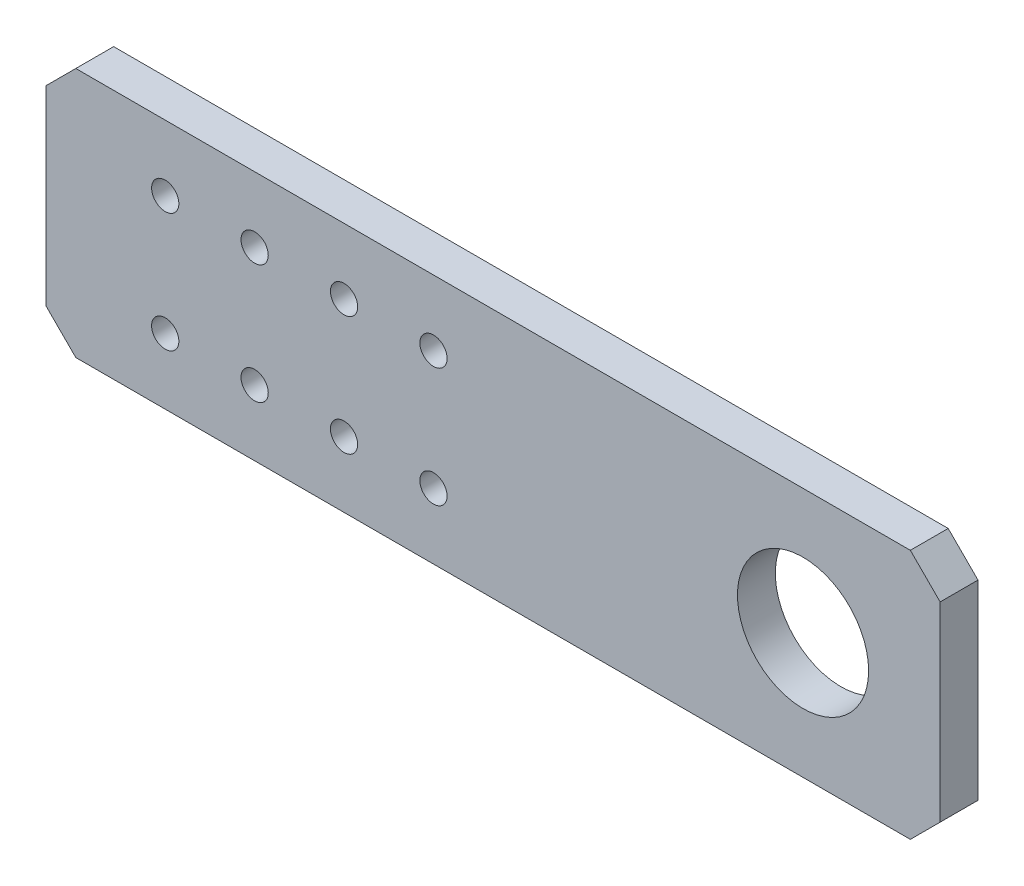
ISO-10303-21;
HEADER;
FILE_DESCRIPTION(('STEP AP214'),'2;1');
FILE_NAME('part.step','',(''),(''),'','','');
FILE_SCHEMA(('AUTOMOTIVE_DESIGN { 1 0 10303 214 1 1 1 1 }'));
ENDSEC;
DATA;
#1=APPLICATION_CONTEXT('core data for automotive mechanical design processes');
#2=APPLICATION_PROTOCOL_DEFINITION('international standard','automotive_design',2000,#1);
#3=PRODUCT_CONTEXT('',#1,'mechanical');
#4=PRODUCT('Part','Part','',(#3));
#5=PRODUCT_RELATED_PRODUCT_CATEGORY('part','',(#4));
#6=PRODUCT_DEFINITION_FORMATION('','',#4);
#7=PRODUCT_DEFINITION_CONTEXT('part definition',#1,'design');
#8=PRODUCT_DEFINITION('design','',#6,#7);
#9=PRODUCT_DEFINITION_SHAPE('','',#8);
#10=(LENGTH_UNIT() NAMED_UNIT(*) SI_UNIT(.MILLI.,.METRE.));
#11=(NAMED_UNIT(*) PLANE_ANGLE_UNIT() SI_UNIT($,.RADIAN.));
#12=(NAMED_UNIT(*) SI_UNIT($,.STERADIAN.) SOLID_ANGLE_UNIT());
#13=UNCERTAINTY_MEASURE_WITH_UNIT(LENGTH_MEASURE(1.E-05),#10,'distance_accuracy_value','');
#14=(GEOMETRIC_REPRESENTATION_CONTEXT(3) GLOBAL_UNCERTAINTY_ASSIGNED_CONTEXT((#13)) GLOBAL_UNIT_ASSIGNED_CONTEXT((#10,
#11,#12)) REPRESENTATION_CONTEXT('',''));
#15=CARTESIAN_POINT('',(0.,0.,0.));
#16=DIRECTION('',(0.,0.,1.));
#17=DIRECTION('',(1.,0.,0.));
#18=AXIS2_PLACEMENT_3D('',#15,#16,#17);
#19=CARTESIAN_POINT('',(-102.5,21.,6.35));
#20=DIRECTION('',(0.,-1.,0.));
#21=DIRECTION('',(0.,0.,-1.));
#22=AXIS2_PLACEMENT_3D('',#19,#20,#21);
#23=PLANE('',#22);
#24=DIRECTION('',(0.,0.,1.));
#25=VECTOR('',#24,1.);
#26=CARTESIAN_POINT('',(-42.5,21.,-3.65));
#27=LINE('',#26,#25);
#28=CARTESIAN_POINT('',(-42.5,21.,0.));
#29=VERTEX_POINT('',#28);
#30=CARTESIAN_POINT('',(-42.5,21.,6.35));
#31=VERTEX_POINT('',#30);
#32=EDGE_CURVE('E122',#29,#31,#27,.T.);
#33=ORIENTED_EDGE('',*,*,#32,.T.);
#34=DIRECTION('',(-1.,0.,0.));
#35=VECTOR('',#34,1.);
#36=CARTESIAN_POINT('',(-102.5,21.,6.35));
#37=LINE('',#36,#35);
#38=CARTESIAN_POINT('',(97.5,21.,6.35));
#39=VERTEX_POINT('',#38);
#40=EDGE_CURVE('E157',#39,#31,#37,.T.);
#41=ORIENTED_EDGE('',*,*,#40,.F.);
#42=DIRECTION('',(0.,0.,-1.));
#43=VECTOR('',#42,1.);
#44=CARTESIAN_POINT('',(97.5,21.,6.35));
#45=LINE('',#44,#43);
#46=CARTESIAN_POINT('',(97.5,21.,0.));
#47=VERTEX_POINT('',#46);
#48=EDGE_CURVE('E173',#39,#47,#45,.T.);
#49=ORIENTED_EDGE('',*,*,#48,.T.);
#50=DIRECTION('',(-1.,0.,0.));
#51=VECTOR('',#50,1.);
#52=CARTESIAN_POINT('',(-102.5,21.,0.));
#53=LINE('',#52,#51);
#54=EDGE_CURVE('E165',#47,#29,#53,.T.);
#55=ORIENTED_EDGE('',*,*,#54,.T.);
#56=EDGE_LOOP('',(#33,#41,#49,#55));
#57=FACE_BOUND('',#56,.T.);
#58=ADVANCED_FACE('F33',(#57),#23,.F.);
#59=CARTESIAN_POINT('',(-102.5,-21.,6.35));
#60=DIRECTION('',(0.,1.,0.));
#61=DIRECTION('',(0.,0.,1.));
#62=AXIS2_PLACEMENT_3D('',#59,#60,#61);
#63=PLANE('',#62);
#64=DIRECTION('',(0.,0.,1.));
#65=VECTOR('',#64,1.);
#66=CARTESIAN_POINT('',(-42.5,-21.,-3.65));
#67=LINE('',#66,#65);
#68=CARTESIAN_POINT('',(-42.5,-21.,0.));
#69=VERTEX_POINT('',#68);
#70=CARTESIAN_POINT('',(-42.5,-21.,6.35));
#71=VERTEX_POINT('',#70);
#72=EDGE_CURVE('E111',#69,#71,#67,.T.);
#73=ORIENTED_EDGE('',*,*,#72,.F.);
#74=DIRECTION('',(1.,0.,0.));
#75=VECTOR('',#74,1.);
#76=CARTESIAN_POINT('',(-102.5,-21.,0.));
#77=LINE('',#76,#75);
#78=CARTESIAN_POINT('',(97.4999999999999,-21.,0.));
#79=VERTEX_POINT('',#78);
#80=EDGE_CURVE('E158',#69,#79,#77,.T.);
#81=ORIENTED_EDGE('',*,*,#80,.T.);
#82=DIRECTION('',(0.,0.,1.));
#83=VECTOR('',#82,1.);
#84=CARTESIAN_POINT('',(97.5,-21.,6.35));
#85=LINE('',#84,#83);
#86=CARTESIAN_POINT('',(97.4999999999999,-21.,6.35));
#87=VERTEX_POINT('',#86);
#88=EDGE_CURVE('E180',#79,#87,#85,.T.);
#89=ORIENTED_EDGE('',*,*,#88,.T.);
#90=DIRECTION('',(1.,0.,0.));
#91=VECTOR('',#90,1.);
#92=CARTESIAN_POINT('',(-102.5,-21.,6.35));
#93=LINE('',#92,#91);
#94=EDGE_CURVE('E56',#71,#87,#93,.T.);
#95=ORIENTED_EDGE('',*,*,#94,.F.);
#96=EDGE_LOOP('',(#73,#81,#89,#95));
#97=FACE_BOUND('',#96,.T.);
#98=ADVANCED_FACE('F220',(#97),#63,.F.);
#99=CARTESIAN_POINT('',(0.,0.,6.35));
#100=DIRECTION('',(0.,0.,1.));
#101=DIRECTION('',(1.,0.,0.));
#102=AXIS2_PLACEMENT_3D('',#99,#100,#101);
#103=PLANE('',#102);
#104=CARTESIAN_POINT('',(-12.5,-10.,6.35));
#105=DIRECTION('',(0.,0.,1.));
#106=DIRECTION('',(1.,0.,0.));
#107=AXIS2_PLACEMENT_3D('',#104,#105,#106);
#108=CIRCLE('',#107,2.286);
#109=CARTESIAN_POINT('',(-10.214,-10.,6.35));
#110=VERTEX_POINT('',#109);
#111=EDGE_CURVE('E131',#110,#110,#108,.F.);
#112=ORIENTED_EDGE('',*,*,#111,.T.);
#113=EDGE_LOOP('',(#112));
#114=FACE_BOUND('',#113,.T.);
#115=CARTESIAN_POINT('',(-27.5,-10.,6.35));
#116=DIRECTION('',(0.,0.,1.));
#117=DIRECTION('',(1.,0.,0.));
#118=AXIS2_PLACEMENT_3D('',#115,#116,#117);
#119=CIRCLE('',#118,2.286);
#120=CARTESIAN_POINT('',(-25.214,-10.,6.35));
#121=VERTEX_POINT('',#120);
#122=EDGE_CURVE('E134',#121,#121,#119,.F.);
#123=ORIENTED_EDGE('',*,*,#122,.T.);
#124=EDGE_LOOP('',(#123));
#125=FACE_BOUND('',#124,.T.);
#126=CARTESIAN_POINT('',(17.5,-9.99999999999999,6.35));
#127=DIRECTION('',(0.,0.,-1.));
#128=DIRECTION('',(-1.,0.,0.));
#129=AXIS2_PLACEMENT_3D('',#126,#127,#128);
#130=CIRCLE('',#129,2.286);
#131=CARTESIAN_POINT('',(15.214,-9.99999999999999,6.35));
#132=VERTEX_POINT('',#131);
#133=EDGE_CURVE('E143',#132,#132,#130,.T.);
#134=ORIENTED_EDGE('',*,*,#133,.T.);
#135=EDGE_LOOP('',(#134));
#136=FACE_BOUND('',#135,.T.);
#137=CARTESIAN_POINT('',(2.49999999999999,-9.99999999999999,6.35));
#138=DIRECTION('',(0.,0.,-1.));
#139=DIRECTION('',(-1.,0.,0.));
#140=AXIS2_PLACEMENT_3D('',#137,#138,#139);
#141=CIRCLE('',#140,2.286);
#142=CARTESIAN_POINT('',(0.213999999999994,-9.99999999999999,6.35));
#143=VERTEX_POINT('',#142);
#144=EDGE_CURVE('E146',#143,#143,#141,.T.);
#145=ORIENTED_EDGE('',*,*,#144,.T.);
#146=EDGE_LOOP('',(#145));
#147=FACE_BOUND('',#146,.T.);
#148=CARTESIAN_POINT('',(79.5,0.,6.35));
#149=DIRECTION('',(0.,0.,1.));
#150=DIRECTION('',(1.,0.,0.));
#151=AXIS2_PLACEMENT_3D('',#148,#149,#150);
#152=CIRCLE('',#151,11.);
#153=CARTESIAN_POINT('',(90.5,0.,6.35));
#154=VERTEX_POINT('',#153);
#155=EDGE_CURVE('E149',#154,#154,#152,.T.);
#156=ORIENTED_EDGE('',*,*,#155,.F.);
#157=EDGE_LOOP('',(#156));
#158=FACE_BOUND('',#157,.T.);
#159=DIRECTION('',(0.,-1.,0.));
#160=VECTOR('',#159,1.);
#161=CARTESIAN_POINT('',(-47.5,0.,6.35));
#162=LINE('',#161,#160);
#163=CARTESIAN_POINT('',(-47.5,16.,6.35));
#164=VERTEX_POINT('',#163);
#165=CARTESIAN_POINT('',(-47.5,-16.,6.35));
#166=VERTEX_POINT('',#165);
#167=EDGE_CURVE('E100',#164,#166,#162,.T.);
#168=ORIENTED_EDGE('',*,*,#167,.T.);
#169=DIRECTION('',(0.707106781186547,-0.707106781186548,0.));
#170=VECTOR('',#169,1.);
#171=CARTESIAN_POINT('',(-31.75,-31.75,6.35));
#172=LINE('',#171,#170);
#173=EDGE_CURVE('E108',#166,#71,#172,.T.);
#174=ORIENTED_EDGE('',*,*,#173,.T.);
#175=ORIENTED_EDGE('',*,*,#94,.T.);
#176=DIRECTION('',(-0.707106781186548,-0.707106781186548,0.));
#177=VECTOR('',#176,1.);
#178=CARTESIAN_POINT('',(59.25,-59.25,6.35));
#179=LINE('',#178,#177);
#180=CARTESIAN_POINT('',(102.5,-16.,6.35));
#181=VERTEX_POINT('',#180);
#182=EDGE_CURVE('E176',#87,#181,#179,.F.);
#183=ORIENTED_EDGE('',*,*,#182,.T.);
#184=DIRECTION('',(0.,1.,0.));
#185=VECTOR('',#184,1.);
#186=CARTESIAN_POINT('',(102.5,21.,6.35));
#187=LINE('',#186,#185);
#188=CARTESIAN_POINT('',(102.5,16.,6.35));
#189=VERTEX_POINT('',#188);
#190=EDGE_CURVE('E154',#181,#189,#187,.T.);
#191=ORIENTED_EDGE('',*,*,#190,.T.);
#192=DIRECTION('',(0.707106781186548,-0.707106781186548,0.));
#193=VECTOR('',#192,1.);
#194=CARTESIAN_POINT('',(59.25,59.25,6.35));
#195=LINE('',#194,#193);
#196=EDGE_CURVE('E178',#189,#39,#195,.F.);
#197=ORIENTED_EDGE('',*,*,#196,.T.);
#198=ORIENTED_EDGE('',*,*,#40,.T.);
#199=DIRECTION('',(-0.707106781186548,-0.707106781186547,0.));
#200=VECTOR('',#199,1.);
#201=CARTESIAN_POINT('',(-31.75,31.75,6.35));
#202=LINE('',#201,#200);
#203=EDGE_CURVE('E106',#31,#164,#202,.T.);
#204=ORIENTED_EDGE('',*,*,#203,.T.);
#205=EDGE_LOOP('',(#168,#174,#175,#183,#191,#197,#198,#204));
#206=FACE_BOUND('',#205,.T.);
#207=CARTESIAN_POINT('',(17.5,9.99999999999999,6.35));
#208=DIRECTION('',(0.,0.,1.));
#209=DIRECTION('',(1.,0.,0.));
#210=AXIS2_PLACEMENT_3D('',#207,#208,#209);
#211=CIRCLE('',#210,2.286);
#212=CARTESIAN_POINT('',(19.786,9.99999999999999,6.35));
#213=VERTEX_POINT('',#212);
#214=EDGE_CURVE('E140',#213,#213,#211,.T.);
#215=ORIENTED_EDGE('',*,*,#214,.F.);
#216=EDGE_LOOP('',(#215));
#217=FACE_BOUND('',#216,.T.);
#218=CARTESIAN_POINT('',(2.49999999999999,9.99999999999998,6.35));
#219=DIRECTION('',(0.,0.,1.));
#220=DIRECTION('',(1.,0.,0.));
#221=AXIS2_PLACEMENT_3D('',#218,#219,#220);
#222=CIRCLE('',#221,2.286);
#223=CARTESIAN_POINT('',(4.78599999999999,9.99999999999998,6.35));
#224=VERTEX_POINT('',#223);
#225=EDGE_CURVE('E137',#224,#224,#222,.T.);
#226=ORIENTED_EDGE('',*,*,#225,.F.);
#227=EDGE_LOOP('',(#226));
#228=FACE_BOUND('',#227,.T.);
#229=CARTESIAN_POINT('',(-12.5,9.99999999999999,6.35));
#230=DIRECTION('',(0.,0.,1.));
#231=DIRECTION('',(1.,0.,0.));
#232=AXIS2_PLACEMENT_3D('',#229,#230,#231);
#233=CIRCLE('',#232,2.286);
#234=CARTESIAN_POINT('',(-10.214,9.99999999999999,6.35));
#235=VERTEX_POINT('',#234);
#236=EDGE_CURVE('E128',#235,#235,#233,.T.);
#237=ORIENTED_EDGE('',*,*,#236,.F.);
#238=EDGE_LOOP('',(#237));
#239=FACE_BOUND('',#238,.T.);
#240=CARTESIAN_POINT('',(-27.5,9.99999999999998,6.35));
#241=DIRECTION('',(0.,0.,1.));
#242=DIRECTION('',(1.,0.,0.));
#243=AXIS2_PLACEMENT_3D('',#240,#241,#242);
#244=CIRCLE('',#243,2.286);
#245=CARTESIAN_POINT('',(-25.214,9.99999999999998,6.35));
#246=VERTEX_POINT('',#245);
#247=EDGE_CURVE('E112',#246,#246,#244,.T.);
#248=ORIENTED_EDGE('',*,*,#247,.F.);
#249=EDGE_LOOP('',(#248));
#250=FACE_BOUND('',#249,.T.);
#251=ADVANCED_FACE('F114',(#114,#125,#136,#147,#158,#206,#217,#228,#239,#250),#103,.T.);
#252=CARTESIAN_POINT('',(0.,0.,0.));
#253=DIRECTION('',(0.,0.,1.));
#254=DIRECTION('',(1.,0.,0.));
#255=AXIS2_PLACEMENT_3D('',#252,#253,#254);
#256=PLANE('',#255);
#257=DIRECTION('',(0.707106781186547,-0.707106781186548,0.));
#258=VECTOR('',#257,1.);
#259=CARTESIAN_POINT('',(-31.75,-31.75,0.));
#260=LINE('',#259,#258);
#261=CARTESIAN_POINT('',(-47.5,-16.,0.));
#262=VERTEX_POINT('',#261);
#263=EDGE_CURVE('E11',#262,#69,#260,.T.);
#264=ORIENTED_EDGE('',*,*,#263,.F.);
#265=DIRECTION('',(0.,-1.,0.));
#266=VECTOR('',#265,1.);
#267=CARTESIAN_POINT('',(-47.5,0.,0.));
#268=LINE('',#267,#266);
#269=CARTESIAN_POINT('',(-47.5,16.,0.));
#270=VERTEX_POINT('',#269);
#271=EDGE_CURVE('E103',#270,#262,#268,.T.);
#272=ORIENTED_EDGE('',*,*,#271,.F.);
#273=DIRECTION('',(-0.707106781186548,-0.707106781186547,0.));
#274=VECTOR('',#273,1.);
#275=CARTESIAN_POINT('',(-31.75,31.75,0.));
#276=LINE('',#275,#274);
#277=EDGE_CURVE('E41',#29,#270,#276,.T.);
#278=ORIENTED_EDGE('',*,*,#277,.F.);
#279=ORIENTED_EDGE('',*,*,#54,.F.);
#280=DIRECTION('',(-0.707106781186548,0.707106781186548,0.));
#281=VECTOR('',#280,1.);
#282=CARTESIAN_POINT('',(97.5,21.,0.));
#283=LINE('',#282,#281);
#284=CARTESIAN_POINT('',(102.5,16.,0.));
#285=VERTEX_POINT('',#284);
#286=EDGE_CURVE('E171',#47,#285,#283,.F.);
#287=ORIENTED_EDGE('',*,*,#286,.T.);
#288=DIRECTION('',(0.,1.,0.));
#289=VECTOR('',#288,1.);
#290=CARTESIAN_POINT('',(102.5,21.,0.));
#291=LINE('',#290,#289);
#292=CARTESIAN_POINT('',(102.5,-16.,0.));
#293=VERTEX_POINT('',#292);
#294=EDGE_CURVE('E162',#293,#285,#291,.T.);
#295=ORIENTED_EDGE('',*,*,#294,.F.);
#296=DIRECTION('',(0.707106781186548,0.707106781186548,0.));
#297=VECTOR('',#296,1.);
#298=CARTESIAN_POINT('',(102.5,-16.,0.));
#299=LINE('',#298,#297);
#300=EDGE_CURVE('E161',#293,#79,#299,.F.);
#301=ORIENTED_EDGE('',*,*,#300,.T.);
#302=ORIENTED_EDGE('',*,*,#80,.F.);
#303=EDGE_LOOP('',(#264,#272,#278,#279,#287,#295,#301,#302));
#304=FACE_BOUND('',#303,.T.);
#305=CARTESIAN_POINT('',(-12.5,9.99999999999999,0.));
#306=DIRECTION('',(0.,0.,1.));
#307=DIRECTION('',(1.,0.,0.));
#308=AXIS2_PLACEMENT_3D('',#305,#306,#307);
#309=CIRCLE('',#308,2.286);
#310=CARTESIAN_POINT('',(-10.214,9.99999999999999,0.));
#311=VERTEX_POINT('',#310);
#312=EDGE_CURVE('E206',#311,#311,#309,.T.);
#313=ORIENTED_EDGE('',*,*,#312,.T.);
#314=EDGE_LOOP('',(#313));
#315=FACE_BOUND('',#314,.T.);
#316=CARTESIAN_POINT('',(-12.5,-10.,0.));
#317=DIRECTION('',(0.,0.,1.));
#318=DIRECTION('',(1.,0.,0.));
#319=AXIS2_PLACEMENT_3D('',#316,#317,#318);
#320=CIRCLE('',#319,2.286);
#321=CARTESIAN_POINT('',(-10.214,-10.,0.));
#322=VERTEX_POINT('',#321);
#323=EDGE_CURVE('E203',#322,#322,#320,.F.);
#324=ORIENTED_EDGE('',*,*,#323,.F.);
#325=EDGE_LOOP('',(#324));
#326=FACE_BOUND('',#325,.T.);
#327=CARTESIAN_POINT('',(-27.5,-10.,0.));
#328=DIRECTION('',(0.,0.,1.));
#329=DIRECTION('',(1.,0.,0.));
#330=AXIS2_PLACEMENT_3D('',#327,#328,#329);
#331=CIRCLE('',#330,2.286);
#332=CARTESIAN_POINT('',(-25.214,-10.,0.));
#333=VERTEX_POINT('',#332);
#334=EDGE_CURVE('E200',#333,#333,#331,.F.);
#335=ORIENTED_EDGE('',*,*,#334,.F.);
#336=EDGE_LOOP('',(#335));
#337=FACE_BOUND('',#336,.T.);
#338=CARTESIAN_POINT('',(17.5,9.99999999999999,0.));
#339=DIRECTION('',(0.,0.,1.));
#340=DIRECTION('',(1.,0.,0.));
#341=AXIS2_PLACEMENT_3D('',#338,#339,#340);
#342=CIRCLE('',#341,2.286);
#343=CARTESIAN_POINT('',(19.786,9.99999999999999,0.));
#344=VERTEX_POINT('',#343);
#345=EDGE_CURVE('E194',#344,#344,#342,.T.);
#346=ORIENTED_EDGE('',*,*,#345,.T.);
#347=EDGE_LOOP('',(#346));
#348=FACE_BOUND('',#347,.T.);
#349=CARTESIAN_POINT('',(17.5,-9.99999999999999,0.));
#350=DIRECTION('',(0.,0.,1.));
#351=DIRECTION('',(1.,0.,0.));
#352=AXIS2_PLACEMENT_3D('',#349,#350,#351);
#353=CIRCLE('',#352,2.286);
#354=CARTESIAN_POINT('',(19.786,-9.99999999999999,0.));
#355=VERTEX_POINT('',#354);
#356=EDGE_CURVE('E191',#355,#355,#353,.F.);
#357=ORIENTED_EDGE('',*,*,#356,.F.);
#358=EDGE_LOOP('',(#357));
#359=FACE_BOUND('',#358,.T.);
#360=CARTESIAN_POINT('',(2.49999999999999,-9.99999999999999,0.));
#361=DIRECTION('',(0.,0.,1.));
#362=DIRECTION('',(1.,0.,0.));
#363=AXIS2_PLACEMENT_3D('',#360,#361,#362);
#364=CIRCLE('',#363,2.286);
#365=CARTESIAN_POINT('',(4.78599999999999,-9.99999999999999,0.));
#366=VERTEX_POINT('',#365);
#367=EDGE_CURVE('E121',#366,#366,#364,.F.);
#368=ORIENTED_EDGE('',*,*,#367,.F.);
#369=EDGE_LOOP('',(#368));
#370=FACE_BOUND('',#369,.T.);
#371=CARTESIAN_POINT('',(79.5,0.,0.));
#372=DIRECTION('',(0.,0.,1.));
#373=DIRECTION('',(1.,0.,0.));
#374=AXIS2_PLACEMENT_3D('',#371,#372,#373);
#375=CIRCLE('',#374,11.);
#376=CARTESIAN_POINT('',(90.5,0.,0.));
#377=VERTEX_POINT('',#376);
#378=EDGE_CURVE('E152',#377,#377,#375,.T.);
#379=ORIENTED_EDGE('',*,*,#378,.T.);
#380=EDGE_LOOP('',(#379));
#381=FACE_BOUND('',#380,.T.);
#382=CARTESIAN_POINT('',(2.49999999999999,9.99999999999998,0.));
#383=DIRECTION('',(0.,0.,1.));
#384=DIRECTION('',(1.,0.,0.));
#385=AXIS2_PLACEMENT_3D('',#382,#383,#384);
#386=CIRCLE('',#385,2.286);
#387=CARTESIAN_POINT('',(4.78599999999999,9.99999999999998,0.));
#388=VERTEX_POINT('',#387);
#389=EDGE_CURVE('E197',#388,#388,#386,.T.);
#390=ORIENTED_EDGE('',*,*,#389,.T.);
#391=EDGE_LOOP('',(#390));
#392=FACE_BOUND('',#391,.T.);
#393=CARTESIAN_POINT('',(-27.5,9.99999999999998,0.));
#394=DIRECTION('',(0.,0.,1.));
#395=DIRECTION('',(1.,0.,0.));
#396=AXIS2_PLACEMENT_3D('',#393,#394,#395);
#397=CIRCLE('',#396,2.286);
#398=CARTESIAN_POINT('',(-25.214,9.99999999999998,0.));
#399=VERTEX_POINT('',#398);
#400=EDGE_CURVE('E153',#399,#399,#397,.T.);
#401=ORIENTED_EDGE('',*,*,#400,.T.);
#402=EDGE_LOOP('',(#401));
#403=FACE_BOUND('',#402,.T.);
#404=ADVANCED_FACE('F216',(#304,#315,#326,#337,#348,#359,#370,#381,#392,#403),#256,.F.);
#405=CARTESIAN_POINT('',(102.5,21.,6.35));
#406=DIRECTION('',(-1.,0.,0.));
#407=DIRECTION('',(0.,0.,1.));
#408=AXIS2_PLACEMENT_3D('',#405,#406,#407);
#409=PLANE('',#408);
#410=ORIENTED_EDGE('',*,*,#294,.T.);
#411=DIRECTION('',(0.,0.,1.));
#412=VECTOR('',#411,1.);
#413=CARTESIAN_POINT('',(102.5,16.,6.35));
#414=LINE('',#413,#412);
#415=EDGE_CURVE('E185',#285,#189,#414,.T.);
#416=ORIENTED_EDGE('',*,*,#415,.T.);
#417=ORIENTED_EDGE('',*,*,#190,.F.);
#418=DIRECTION('',(0.,0.,-1.));
#419=VECTOR('',#418,1.);
#420=CARTESIAN_POINT('',(102.5,-16.,6.35));
#421=LINE('',#420,#419);
#422=EDGE_CURVE('E182',#181,#293,#421,.T.);
#423=ORIENTED_EDGE('',*,*,#422,.T.);
#424=EDGE_LOOP('',(#410,#416,#417,#423));
#425=FACE_BOUND('',#424,.T.);
#426=ADVANCED_FACE('F228',(#425),#409,.F.);
#427=CARTESIAN_POINT('',(97.5,21.,6.35));
#428=DIRECTION('',(-0.707106781186548,-0.707106781186548,0.));
#429=DIRECTION('',(0.,0.,-1.));
#430=AXIS2_PLACEMENT_3D('',#427,#428,#429);
#431=PLANE('',#430);
#432=ORIENTED_EDGE('',*,*,#196,.F.);
#433=ORIENTED_EDGE('',*,*,#415,.F.);
#434=ORIENTED_EDGE('',*,*,#286,.F.);
#435=ORIENTED_EDGE('',*,*,#48,.F.);
#436=EDGE_LOOP('',(#432,#433,#434,#435));
#437=FACE_BOUND('',#436,.T.);
#438=ADVANCED_FACE('F232',(#437),#431,.F.);
#439=CARTESIAN_POINT('',(102.5,-16.,6.35));
#440=DIRECTION('',(-0.707106781186547,0.707106781186547,0.));
#441=DIRECTION('',(0.,0.,-1.));
#442=AXIS2_PLACEMENT_3D('',#439,#440,#441);
#443=PLANE('',#442);
#444=ORIENTED_EDGE('',*,*,#182,.F.);
#445=ORIENTED_EDGE('',*,*,#88,.F.);
#446=ORIENTED_EDGE('',*,*,#300,.F.);
#447=ORIENTED_EDGE('',*,*,#422,.F.);
#448=EDGE_LOOP('',(#444,#445,#446,#447));
#449=FACE_BOUND('',#448,.T.);
#450=ADVANCED_FACE('F35',(#449),#443,.F.);
#451=CARTESIAN_POINT('',(79.5,0.,-18.65));
#452=DIRECTION('',(0.,0.,1.));
#453=DIRECTION('',(1.,0.,0.));
#454=AXIS2_PLACEMENT_3D('',#451,#452,#453);
#455=CYLINDRICAL_SURFACE('',#454,11.);
#456=ORIENTED_EDGE('',*,*,#155,.T.);
#457=EDGE_LOOP('',(#456));
#458=FACE_BOUND('',#457,.T.);
#459=ORIENTED_EDGE('',*,*,#378,.F.);
#460=EDGE_LOOP('',(#459));
#461=FACE_BOUND('',#460,.T.);
#462=ADVANCED_FACE('F249',(#458,#461),#455,.F.);
#463=CARTESIAN_POINT('',(2.49999999999999,-9.99999999999999,-3.65));
#464=DIRECTION('',(0.,0.,1.));
#465=DIRECTION('',(1.,0.,0.));
#466=AXIS2_PLACEMENT_3D('',#463,#464,#465);
#467=CYLINDRICAL_SURFACE('',#466,2.286);
#468=ORIENTED_EDGE('',*,*,#144,.F.);
#469=EDGE_LOOP('',(#468));
#470=FACE_BOUND('',#469,.T.);
#471=ORIENTED_EDGE('',*,*,#367,.T.);
#472=EDGE_LOOP('',(#471));
#473=FACE_BOUND('',#472,.T.);
#474=ADVANCED_FACE('F253',(#470,#473),#467,.F.);
#475=CARTESIAN_POINT('',(17.5,-9.99999999999999,-3.65));
#476=DIRECTION('',(0.,0.,1.));
#477=DIRECTION('',(1.,0.,0.));
#478=AXIS2_PLACEMENT_3D('',#475,#476,#477);
#479=CYLINDRICAL_SURFACE('',#478,2.286);
#480=ORIENTED_EDGE('',*,*,#133,.F.);
#481=EDGE_LOOP('',(#480));
#482=FACE_BOUND('',#481,.T.);
#483=ORIENTED_EDGE('',*,*,#356,.T.);
#484=EDGE_LOOP('',(#483));
#485=FACE_BOUND('',#484,.T.);
#486=ADVANCED_FACE('F259',(#482,#485),#479,.F.);
#487=CARTESIAN_POINT('',(17.5,9.99999999999999,-3.65));
#488=DIRECTION('',(0.,0.,1.));
#489=DIRECTION('',(1.,0.,0.));
#490=AXIS2_PLACEMENT_3D('',#487,#488,#489);
#491=CYLINDRICAL_SURFACE('',#490,2.286);
#492=ORIENTED_EDGE('',*,*,#214,.T.);
#493=EDGE_LOOP('',(#492));
#494=FACE_BOUND('',#493,.T.);
#495=ORIENTED_EDGE('',*,*,#345,.F.);
#496=EDGE_LOOP('',(#495));
#497=FACE_BOUND('',#496,.T.);
#498=ADVANCED_FACE('F319',(#494,#497),#491,.F.);
#499=CARTESIAN_POINT('',(2.49999999999999,9.99999999999998,-3.65));
#500=DIRECTION('',(0.,0.,1.));
#501=DIRECTION('',(1.,0.,0.));
#502=AXIS2_PLACEMENT_3D('',#499,#500,#501);
#503=CYLINDRICAL_SURFACE('',#502,2.286);
#504=ORIENTED_EDGE('',*,*,#225,.T.);
#505=EDGE_LOOP('',(#504));
#506=FACE_BOUND('',#505,.T.);
#507=ORIENTED_EDGE('',*,*,#389,.F.);
#508=EDGE_LOOP('',(#507));
#509=FACE_BOUND('',#508,.T.);
#510=ADVANCED_FACE('F327',(#506,#509),#503,.F.);
#511=CARTESIAN_POINT('',(-27.5,-10.,-3.65));
#512=DIRECTION('',(0.,0.,1.));
#513=DIRECTION('',(1.,0.,0.));
#514=AXIS2_PLACEMENT_3D('',#511,#512,#513);
#515=CYLINDRICAL_SURFACE('',#514,2.286);
#516=ORIENTED_EDGE('',*,*,#122,.F.);
#517=EDGE_LOOP('',(#516));
#518=FACE_BOUND('',#517,.T.);
#519=ORIENTED_EDGE('',*,*,#334,.T.);
#520=EDGE_LOOP('',(#519));
#521=FACE_BOUND('',#520,.T.);
#522=ADVANCED_FACE('F336',(#518,#521),#515,.F.);
#523=CARTESIAN_POINT('',(-12.5,-10.,-3.65));
#524=DIRECTION('',(0.,0.,1.));
#525=DIRECTION('',(1.,0.,0.));
#526=AXIS2_PLACEMENT_3D('',#523,#524,#525);
#527=CYLINDRICAL_SURFACE('',#526,2.286);
#528=ORIENTED_EDGE('',*,*,#111,.F.);
#529=EDGE_LOOP('',(#528));
#530=FACE_BOUND('',#529,.T.);
#531=ORIENTED_EDGE('',*,*,#323,.T.);
#532=EDGE_LOOP('',(#531));
#533=FACE_BOUND('',#532,.T.);
#534=ADVANCED_FACE('F345',(#530,#533),#527,.F.);
#535=CARTESIAN_POINT('',(-12.5,9.99999999999999,-3.65));
#536=DIRECTION('',(0.,0.,1.));
#537=DIRECTION('',(1.,0.,0.));
#538=AXIS2_PLACEMENT_3D('',#535,#536,#537);
#539=CYLINDRICAL_SURFACE('',#538,2.286);
#540=ORIENTED_EDGE('',*,*,#236,.T.);
#541=EDGE_LOOP('',(#540));
#542=FACE_BOUND('',#541,.T.);
#543=ORIENTED_EDGE('',*,*,#312,.F.);
#544=EDGE_LOOP('',(#543));
#545=FACE_BOUND('',#544,.T.);
#546=ADVANCED_FACE('F354',(#542,#545),#539,.F.);
#547=CARTESIAN_POINT('',(-27.5,9.99999999999998,-3.65));
#548=DIRECTION('',(0.,0.,1.));
#549=DIRECTION('',(1.,0.,0.));
#550=AXIS2_PLACEMENT_3D('',#547,#548,#549);
#551=CYLINDRICAL_SURFACE('',#550,2.286);
#552=ORIENTED_EDGE('',*,*,#247,.T.);
#553=EDGE_LOOP('',(#552));
#554=FACE_BOUND('',#553,.T.);
#555=ORIENTED_EDGE('',*,*,#400,.F.);
#556=EDGE_LOOP('',(#555));
#557=FACE_BOUND('',#556,.T.);
#558=ADVANCED_FACE('F363',(#554,#557),#551,.F.);
#559=CARTESIAN_POINT('',(-31.75,-31.75,-3.65));
#560=DIRECTION('',(-0.707106781186548,-0.707106781186547,0.));
#561=DIRECTION('',(0.707106781186547,-0.707106781186548,0.));
#562=AXIS2_PLACEMENT_3D('',#559,#560,#561);
#563=PLANE('',#562);
#564=ORIENTED_EDGE('',*,*,#263,.T.);
#565=ORIENTED_EDGE('',*,*,#72,.T.);
#566=ORIENTED_EDGE('',*,*,#173,.F.);
#567=DIRECTION('',(0.,0.,1.));
#568=VECTOR('',#567,1.);
#569=CARTESIAN_POINT('',(-47.5,-16.,-3.65));
#570=LINE('',#569,#568);
#571=EDGE_CURVE('E96',#262,#166,#570,.T.);
#572=ORIENTED_EDGE('',*,*,#571,.F.);
#573=EDGE_LOOP('',(#564,#565,#566,#572));
#574=FACE_BOUND('',#573,.T.);
#575=ADVANCED_FACE('F109',(#574),#563,.T.);
#576=CARTESIAN_POINT('',(-31.75,31.75,-3.65));
#577=DIRECTION('',(-0.707106781186547,0.707106781186548,0.));
#578=DIRECTION('',(-0.707106781186548,-0.707106781186547,0.));
#579=AXIS2_PLACEMENT_3D('',#576,#577,#578);
#580=PLANE('',#579);
#581=ORIENTED_EDGE('',*,*,#277,.T.);
#582=DIRECTION('',(0.,0.,1.));
#583=VECTOR('',#582,1.);
#584=CARTESIAN_POINT('',(-47.5,16.,-3.65));
#585=LINE('',#584,#583);
#586=EDGE_CURVE('E48',#270,#164,#585,.T.);
#587=ORIENTED_EDGE('',*,*,#586,.T.);
#588=ORIENTED_EDGE('',*,*,#203,.F.);
#589=ORIENTED_EDGE('',*,*,#32,.F.);
#590=EDGE_LOOP('',(#581,#587,#588,#589));
#591=FACE_BOUND('',#590,.T.);
#592=ADVANCED_FACE('F213',(#591),#580,.T.);
#593=CARTESIAN_POINT('',(-47.5,0.,-3.65));
#594=DIRECTION('',(-1.,0.,0.));
#595=DIRECTION('',(0.,0.,1.));
#596=AXIS2_PLACEMENT_3D('',#593,#594,#595);
#597=PLANE('',#596);
#598=ORIENTED_EDGE('',*,*,#271,.T.);
#599=ORIENTED_EDGE('',*,*,#571,.T.);
#600=ORIENTED_EDGE('',*,*,#167,.F.);
#601=ORIENTED_EDGE('',*,*,#586,.F.);
#602=EDGE_LOOP('',(#598,#599,#600,#601));
#603=FACE_BOUND('',#602,.T.);
#604=ADVANCED_FACE('F98',(#603),#597,.T.);
#605=CLOSED_SHELL('',(#58,#98,#251,#404,#426,#438,#450,#462,#474,#486,#498,#510,#522,#534,#546,
#558,#575,#592,#604));
#606=MANIFOLD_SOLID_BREP('B2',#605);
#607=ADVANCED_BREP_SHAPE_REPRESENTATION('',(#18,#606),#14);
#608=SHAPE_DEFINITION_REPRESENTATION(#9,#607);
ENDSEC;
END-ISO-10303-21;
